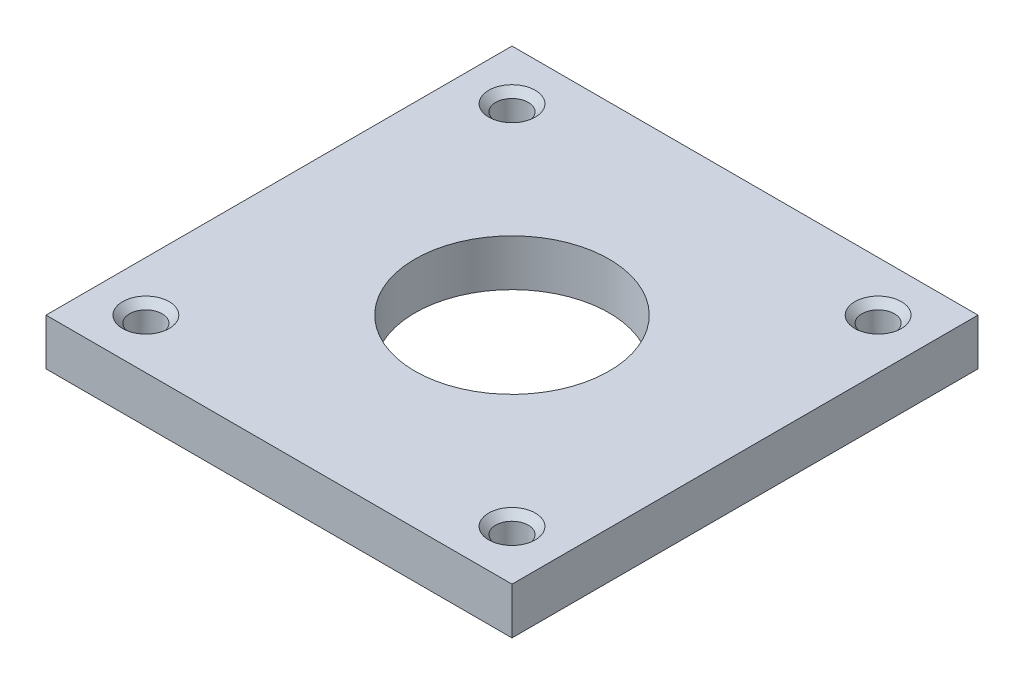
ISO-10303-21;
HEADER;
FILE_DESCRIPTION(('STEP AP214'),'2;1');
FILE_NAME('part.step','',(''),(''),'','','');
FILE_SCHEMA(('AUTOMOTIVE_DESIGN { 1 0 10303 214 1 1 1 1 }'));
ENDSEC;
DATA;
#1=APPLICATION_CONTEXT('core data for automotive mechanical design processes');
#2=APPLICATION_PROTOCOL_DEFINITION('international standard','automotive_design',2000,#1);
#3=PRODUCT_CONTEXT('',#1,'mechanical');
#4=PRODUCT('Part','Part','',(#3));
#5=PRODUCT_RELATED_PRODUCT_CATEGORY('part','',(#4));
#6=PRODUCT_DEFINITION_FORMATION('','',#4);
#7=PRODUCT_DEFINITION_CONTEXT('part definition',#1,'design');
#8=PRODUCT_DEFINITION('design','',#6,#7);
#9=PRODUCT_DEFINITION_SHAPE('','',#8);
#10=(LENGTH_UNIT() NAMED_UNIT(*) SI_UNIT(.MILLI.,.METRE.));
#11=(NAMED_UNIT(*) PLANE_ANGLE_UNIT() SI_UNIT($,.RADIAN.));
#12=(NAMED_UNIT(*) SI_UNIT($,.STERADIAN.) SOLID_ANGLE_UNIT());
#13=UNCERTAINTY_MEASURE_WITH_UNIT(LENGTH_MEASURE(1.E-05),#10,'distance_accuracy_value','');
#14=(GEOMETRIC_REPRESENTATION_CONTEXT(3) GLOBAL_UNCERTAINTY_ASSIGNED_CONTEXT((#13)) GLOBAL_UNIT_ASSIGNED_CONTEXT((#10,
#11,#12)) REPRESENTATION_CONTEXT('',''));
#15=CARTESIAN_POINT('',(0.,0.,0.));
#16=DIRECTION('',(0.,0.,1.));
#17=DIRECTION('',(1.,0.,0.));
#18=AXIS2_PLACEMENT_3D('',#15,#16,#17);
#19=CARTESIAN_POINT('',(0.,6.,0.));
#20=DIRECTION('',(0.,1.,0.));
#21=DIRECTION('',(0.,0.,1.));
#22=AXIS2_PLACEMENT_3D('',#19,#20,#21);
#23=PLANE('',#22);
#24=CARTESIAN_POINT('',(-23.57,6.,86.5280111423957));
#25=DIRECTION('',(0.,1.,0.));
#26=DIRECTION('',(0.,0.,1.));
#27=AXIS2_PLACEMENT_3D('',#24,#25,#26);
#28=CIRCLE('',#27,3.);
#29=CARTESIAN_POINT('',(-23.57,6.,89.5280111423957));
#30=VERTEX_POINT('',#29);
#31=EDGE_CURVE('E215',#30,#30,#28,.T.);
#32=ORIENTED_EDGE('',*,*,#31,.F.);
#33=EDGE_LOOP('',(#32));
#34=FACE_BOUND('',#33,.T.);
#35=CARTESIAN_POINT('',(23.57,6.,86.5280111423957));
#36=DIRECTION('',(0.,1.,0.));
#37=DIRECTION('',(0.,0.,1.));
#38=AXIS2_PLACEMENT_3D('',#35,#36,#37);
#39=CIRCLE('',#38,3.);
#40=CARTESIAN_POINT('',(23.57,6.,89.5280111423957));
#41=VERTEX_POINT('',#40);
#42=EDGE_CURVE('E200',#41,#41,#39,.T.);
#43=ORIENTED_EDGE('',*,*,#42,.F.);
#44=EDGE_LOOP('',(#43));
#45=FACE_BOUND('',#44,.T.);
#46=CARTESIAN_POINT('',(23.57,6.,133.668011142396));
#47=DIRECTION('',(0.,1.,0.));
#48=DIRECTION('',(0.,0.,1.));
#49=AXIS2_PLACEMENT_3D('',#46,#47,#48);
#50=CIRCLE('',#49,3.);
#51=CARTESIAN_POINT('',(23.57,6.,136.668011142396));
#52=VERTEX_POINT('',#51);
#53=EDGE_CURVE('E184',#52,#52,#50,.T.);
#54=ORIENTED_EDGE('',*,*,#53,.F.);
#55=EDGE_LOOP('',(#54));
#56=FACE_BOUND('',#55,.T.);
#57=CARTESIAN_POINT('',(-23.57,6.,133.668011142396));
#58=DIRECTION('',(0.,1.,0.));
#59=DIRECTION('',(0.,0.,1.));
#60=AXIS2_PLACEMENT_3D('',#57,#58,#59);
#61=CIRCLE('',#60,3.);
#62=CARTESIAN_POINT('',(-23.57,6.,136.668011142396));
#63=VERTEX_POINT('',#62);
#64=EDGE_CURVE('E170',#63,#63,#61,.T.);
#65=ORIENTED_EDGE('',*,*,#64,.F.);
#66=EDGE_LOOP('',(#65));
#67=FACE_BOUND('',#66,.T.);
#68=DIRECTION('',(0.,0.,1.));
#69=VECTOR('',#68,1.);
#70=CARTESIAN_POINT('',(-30.,6.,80.0980111423957));
#71=LINE('',#70,#69);
#72=CARTESIAN_POINT('',(-30.,6.,80.0980111423957));
#73=VERTEX_POINT('',#72);
#74=CARTESIAN_POINT('',(-30.,6.,140.098011142396));
#75=VERTEX_POINT('',#74);
#76=EDGE_CURVE('E111',#73,#75,#71,.T.);
#77=ORIENTED_EDGE('',*,*,#76,.T.);
#78=DIRECTION('',(1.,0.,0.));
#79=VECTOR('',#78,1.);
#80=CARTESIAN_POINT('',(-30.,6.,140.098011142396));
#81=LINE('',#80,#79);
#82=CARTESIAN_POINT('',(30.,6.,140.098011142396));
#83=VERTEX_POINT('',#82);
#84=EDGE_CURVE('E106',#75,#83,#81,.T.);
#85=ORIENTED_EDGE('',*,*,#84,.T.);
#86=DIRECTION('',(0.,0.,-1.));
#87=VECTOR('',#86,1.);
#88=CARTESIAN_POINT('',(30.,6.,140.098011142396));
#89=LINE('',#88,#87);
#90=CARTESIAN_POINT('',(30.,6.,80.0980111423957));
#91=VERTEX_POINT('',#90);
#92=EDGE_CURVE('E109',#83,#91,#89,.T.);
#93=ORIENTED_EDGE('',*,*,#92,.T.);
#94=DIRECTION('',(-1.,0.,0.));
#95=VECTOR('',#94,1.);
#96=CARTESIAN_POINT('',(-30.,6.,80.0980111423957));
#97=LINE('',#96,#95);
#98=EDGE_CURVE('E76',#91,#73,#97,.T.);
#99=ORIENTED_EDGE('',*,*,#98,.T.);
#100=EDGE_LOOP('',(#77,#85,#93,#99));
#101=FACE_BOUND('',#100,.T.);
#102=CARTESIAN_POINT('',(0.,6.,110.098011142396));
#103=DIRECTION('',(0.,1.,0.));
#104=DIRECTION('',(0.,0.,1.));
#105=AXIS2_PLACEMENT_3D('',#102,#103,#104);
#106=CIRCLE('',#105,12.5);
#107=CARTESIAN_POINT('',(0.,6.,122.598011142396));
#108=VERTEX_POINT('',#107);
#109=EDGE_CURVE('E134',#108,#108,#106,.T.);
#110=ORIENTED_EDGE('',*,*,#109,.F.);
#111=EDGE_LOOP('',(#110));
#112=FACE_BOUND('',#111,.T.);
#113=ADVANCED_FACE('F58',(#34,#45,#56,#67,#101,#112),#23,.T.);
#114=CARTESIAN_POINT('',(0.,0.,0.));
#115=DIRECTION('',(0.,1.,0.));
#116=DIRECTION('',(0.,0.,1.));
#117=AXIS2_PLACEMENT_3D('',#114,#115,#116);
#118=PLANE('',#117);
#119=CARTESIAN_POINT('',(-23.57,0.,86.5280111423957));
#120=DIRECTION('',(0.,1.,0.));
#121=DIRECTION('',(0.,0.,1.));
#122=AXIS2_PLACEMENT_3D('',#119,#120,#121);
#123=CIRCLE('',#122,3.);
#124=CARTESIAN_POINT('',(-23.57,0.,89.5280111423957));
#125=VERTEX_POINT('',#124);
#126=EDGE_CURVE('E219',#125,#125,#123,.T.);
#127=ORIENTED_EDGE('',*,*,#126,.T.);
#128=EDGE_LOOP('',(#127));
#129=FACE_BOUND('',#128,.T.);
#130=CARTESIAN_POINT('',(23.57,0.,86.5280111423957));
#131=DIRECTION('',(0.,1.,0.));
#132=DIRECTION('',(0.,0.,1.));
#133=AXIS2_PLACEMENT_3D('',#130,#131,#132);
#134=CIRCLE('',#133,3.);
#135=CARTESIAN_POINT('',(23.57,0.,89.5280111423957));
#136=VERTEX_POINT('',#135);
#137=EDGE_CURVE('E203',#136,#136,#134,.T.);
#138=ORIENTED_EDGE('',*,*,#137,.T.);
#139=EDGE_LOOP('',(#138));
#140=FACE_BOUND('',#139,.T.);
#141=CARTESIAN_POINT('',(23.57,0.,133.668011142396));
#142=DIRECTION('',(0.,1.,0.));
#143=DIRECTION('',(0.,0.,1.));
#144=AXIS2_PLACEMENT_3D('',#141,#142,#143);
#145=CIRCLE('',#144,3.);
#146=CARTESIAN_POINT('',(23.57,0.,136.668011142396));
#147=VERTEX_POINT('',#146);
#148=EDGE_CURVE('E188',#147,#147,#145,.T.);
#149=ORIENTED_EDGE('',*,*,#148,.T.);
#150=EDGE_LOOP('',(#149));
#151=FACE_BOUND('',#150,.T.);
#152=CARTESIAN_POINT('',(-23.57,0.,133.668011142396));
#153=DIRECTION('',(0.,1.,0.));
#154=DIRECTION('',(0.,0.,1.));
#155=AXIS2_PLACEMENT_3D('',#152,#153,#154);
#156=CIRCLE('',#155,3.);
#157=CARTESIAN_POINT('',(-23.57,0.,136.668011142396));
#158=VERTEX_POINT('',#157);
#159=EDGE_CURVE('E174',#158,#158,#156,.T.);
#160=ORIENTED_EDGE('',*,*,#159,.T.);
#161=EDGE_LOOP('',(#160));
#162=FACE_BOUND('',#161,.T.);
#163=DIRECTION('',(0.,0.,1.));
#164=VECTOR('',#163,1.);
#165=CARTESIAN_POINT('',(-30.,0.,80.0980111423957));
#166=LINE('',#165,#164);
#167=CARTESIAN_POINT('',(-30.,0.,80.0980111423957));
#168=VERTEX_POINT('',#167);
#169=CARTESIAN_POINT('',(-30.,0.,140.098011142396));
#170=VERTEX_POINT('',#169);
#171=EDGE_CURVE('E130',#168,#170,#166,.T.);
#172=ORIENTED_EDGE('',*,*,#171,.F.);
#173=DIRECTION('',(-1.,0.,0.));
#174=VECTOR('',#173,1.);
#175=CARTESIAN_POINT('',(-30.,0.,80.0980111423957));
#176=LINE('',#175,#174);
#177=CARTESIAN_POINT('',(30.,0.,80.0980111423957));
#178=VERTEX_POINT('',#177);
#179=EDGE_CURVE('E99',#178,#168,#176,.T.);
#180=ORIENTED_EDGE('',*,*,#179,.F.);
#181=DIRECTION('',(0.,0.,-1.));
#182=VECTOR('',#181,1.);
#183=CARTESIAN_POINT('',(30.,0.,140.098011142396));
#184=LINE('',#183,#182);
#185=CARTESIAN_POINT('',(30.,0.,140.098011142396));
#186=VERTEX_POINT('',#185);
#187=EDGE_CURVE('E93',#186,#178,#184,.T.);
#188=ORIENTED_EDGE('',*,*,#187,.F.);
#189=DIRECTION('',(1.,0.,0.));
#190=VECTOR('',#189,1.);
#191=CARTESIAN_POINT('',(-30.,0.,140.098011142396));
#192=LINE('',#191,#190);
#193=EDGE_CURVE('E116',#170,#186,#192,.T.);
#194=ORIENTED_EDGE('',*,*,#193,.F.);
#195=EDGE_LOOP('',(#172,#180,#188,#194));
#196=FACE_BOUND('',#195,.T.);
#197=CARTESIAN_POINT('',(0.,0.,110.098011142396));
#198=DIRECTION('',(0.,1.,0.));
#199=DIRECTION('',(0.,0.,1.));
#200=AXIS2_PLACEMENT_3D('',#197,#198,#199);
#201=CIRCLE('',#200,12.5);
#202=CARTESIAN_POINT('',(0.,0.,122.598011142396));
#203=VERTEX_POINT('',#202);
#204=EDGE_CURVE('E156',#203,#203,#201,.T.);
#205=ORIENTED_EDGE('',*,*,#204,.T.);
#206=EDGE_LOOP('',(#205));
#207=FACE_BOUND('',#206,.T.);
#208=ADVANCED_FACE('F149',(#129,#140,#151,#162,#196,#207),#118,.F.);
#209=CARTESIAN_POINT('',(-30.,6.,80.0980111423957));
#210=DIRECTION('',(1.,0.,0.));
#211=DIRECTION('',(0.,0.,-1.));
#212=AXIS2_PLACEMENT_3D('',#209,#210,#211);
#213=PLANE('',#212);
#214=ORIENTED_EDGE('',*,*,#171,.T.);
#215=DIRECTION('',(0.,-1.,0.));
#216=VECTOR('',#215,1.);
#217=CARTESIAN_POINT('',(-30.,6.,140.098011142396));
#218=LINE('',#217,#216);
#219=EDGE_CURVE('E11',#75,#170,#218,.T.);
#220=ORIENTED_EDGE('',*,*,#219,.F.);
#221=ORIENTED_EDGE('',*,*,#76,.F.);
#222=DIRECTION('',(0.,-1.,0.));
#223=VECTOR('',#222,1.);
#224=CARTESIAN_POINT('',(-30.,6.,80.0980111423957));
#225=LINE('',#224,#223);
#226=EDGE_CURVE('E126',#73,#168,#225,.T.);
#227=ORIENTED_EDGE('',*,*,#226,.T.);
#228=EDGE_LOOP('',(#214,#220,#221,#227));
#229=FACE_BOUND('',#228,.T.);
#230=ADVANCED_FACE('F60',(#229),#213,.F.);
#231=CARTESIAN_POINT('',(-30.,6.,140.098011142396));
#232=DIRECTION('',(0.,0.,-1.));
#233=DIRECTION('',(-1.,0.,0.));
#234=AXIS2_PLACEMENT_3D('',#231,#232,#233);
#235=PLANE('',#234);
#236=ORIENTED_EDGE('',*,*,#193,.T.);
#237=DIRECTION('',(0.,-1.,0.));
#238=VECTOR('',#237,1.);
#239=CARTESIAN_POINT('',(30.,6.,140.098011142396));
#240=LINE('',#239,#238);
#241=EDGE_CURVE('E68',#83,#186,#240,.T.);
#242=ORIENTED_EDGE('',*,*,#241,.F.);
#243=ORIENTED_EDGE('',*,*,#84,.F.);
#244=ORIENTED_EDGE('',*,*,#219,.T.);
#245=EDGE_LOOP('',(#236,#242,#243,#244));
#246=FACE_BOUND('',#245,.T.);
#247=ADVANCED_FACE('F115',(#246),#235,.F.);
#248=CARTESIAN_POINT('',(30.,6.,140.098011142396));
#249=DIRECTION('',(-1.,0.,0.));
#250=DIRECTION('',(0.,0.,1.));
#251=AXIS2_PLACEMENT_3D('',#248,#249,#250);
#252=PLANE('',#251);
#253=ORIENTED_EDGE('',*,*,#187,.T.);
#254=DIRECTION('',(0.,-1.,0.));
#255=VECTOR('',#254,1.);
#256=CARTESIAN_POINT('',(30.,6.,80.0980111423957));
#257=LINE('',#256,#255);
#258=EDGE_CURVE('E118',#91,#178,#257,.T.);
#259=ORIENTED_EDGE('',*,*,#258,.F.);
#260=ORIENTED_EDGE('',*,*,#92,.F.);
#261=ORIENTED_EDGE('',*,*,#241,.T.);
#262=EDGE_LOOP('',(#253,#259,#260,#261));
#263=FACE_BOUND('',#262,.T.);
#264=ADVANCED_FACE('F119',(#263),#252,.F.);
#265=CARTESIAN_POINT('',(-30.,6.,80.0980111423957));
#266=DIRECTION('',(0.,0.,1.));
#267=DIRECTION('',(1.,0.,0.));
#268=AXIS2_PLACEMENT_3D('',#265,#266,#267);
#269=PLANE('',#268);
#270=ORIENTED_EDGE('',*,*,#179,.T.);
#271=ORIENTED_EDGE('',*,*,#226,.F.);
#272=ORIENTED_EDGE('',*,*,#98,.F.);
#273=ORIENTED_EDGE('',*,*,#258,.T.);
#274=EDGE_LOOP('',(#270,#271,#272,#273));
#275=FACE_BOUND('',#274,.T.);
#276=ADVANCED_FACE('F146',(#275),#269,.F.);
#277=CARTESIAN_POINT('',(0.,6.,110.098011142396));
#278=DIRECTION('',(0.,-1.,0.));
#279=DIRECTION('',(0.,0.,-1.));
#280=AXIS2_PLACEMENT_3D('',#277,#278,#279);
#281=CYLINDRICAL_SURFACE('',#280,12.5);
#282=ORIENTED_EDGE('',*,*,#109,.T.);
#283=EDGE_LOOP('',(#282));
#284=FACE_BOUND('',#283,.T.);
#285=ORIENTED_EDGE('',*,*,#204,.F.);
#286=EDGE_LOOP('',(#285));
#287=FACE_BOUND('',#286,.T.);
#288=ADVANCED_FACE('F276',(#284,#287),#281,.F.);
#289=CARTESIAN_POINT('',(-23.57,0.900000000000003,133.668011142396));
#290=DIRECTION('',(0.,-1.,0.));
#291=DIRECTION('',(0.,0.,-1.));
#292=AXIS2_PLACEMENT_3D('',#289,#290,#291);
#293=CONICAL_SURFACE('',#292,2.1,0.785398163397448);
#294=ORIENTED_EDGE('',*,*,#159,.F.);
#295=EDGE_LOOP('',(#294));
#296=FACE_BOUND('',#295,.T.);
#297=CARTESIAN_POINT('',(-23.57,0.900000000000003,133.668011142396));
#298=DIRECTION('',(0.,1.,0.));
#299=DIRECTION('',(0.,0.,1.));
#300=AXIS2_PLACEMENT_3D('',#297,#298,#299);
#301=CIRCLE('',#300,2.1);
#302=CARTESIAN_POINT('',(-23.57,0.900000000000003,135.768011142396));
#303=VERTEX_POINT('',#302);
#304=EDGE_CURVE('E160',#303,#303,#301,.T.);
#305=ORIENTED_EDGE('',*,*,#304,.T.);
#306=EDGE_LOOP('',(#305));
#307=FACE_BOUND('',#306,.T.);
#308=ADVANCED_FACE('F268',(#296,#307),#293,.F.);
#309=CARTESIAN_POINT('',(-23.57,6.,133.668011142396));
#310=DIRECTION('',(0.,1.,0.));
#311=DIRECTION('',(0.,0.,1.));
#312=AXIS2_PLACEMENT_3D('',#309,#310,#311);
#313=CYLINDRICAL_SURFACE('',#312,2.1);
#314=ORIENTED_EDGE('',*,*,#304,.F.);
#315=EDGE_LOOP('',(#314));
#316=FACE_BOUND('',#315,.T.);
#317=CARTESIAN_POINT('',(-23.57,5.1,133.668011142396));
#318=DIRECTION('',(0.,1.,0.));
#319=DIRECTION('',(0.,0.,1.));
#320=AXIS2_PLACEMENT_3D('',#317,#318,#319);
#321=CIRCLE('',#320,2.1);
#322=CARTESIAN_POINT('',(-23.57,5.1,135.768011142396));
#323=VERTEX_POINT('',#322);
#324=EDGE_CURVE('E166',#323,#323,#321,.T.);
#325=ORIENTED_EDGE('',*,*,#324,.T.);
#326=EDGE_LOOP('',(#325));
#327=FACE_BOUND('',#326,.T.);
#328=ADVANCED_FACE('F258',(#316,#327),#313,.F.);
#329=CARTESIAN_POINT('',(-23.57,6.,133.668011142396));
#330=DIRECTION('',(0.,1.,0.));
#331=DIRECTION('',(0.,0.,1.));
#332=AXIS2_PLACEMENT_3D('',#329,#330,#331);
#333=CONICAL_SURFACE('',#332,3.,0.785398163397446);
#334=ORIENTED_EDGE('',*,*,#324,.F.);
#335=EDGE_LOOP('',(#334));
#336=FACE_BOUND('',#335,.T.);
#337=ORIENTED_EDGE('',*,*,#64,.T.);
#338=EDGE_LOOP('',(#337));
#339=FACE_BOUND('',#338,.T.);
#340=ADVANCED_FACE('F255',(#336,#339),#333,.F.);
#341=CARTESIAN_POINT('',(23.57,0.900000000000003,133.668011142396));
#342=DIRECTION('',(0.,-1.,0.));
#343=DIRECTION('',(0.,0.,-1.));
#344=AXIS2_PLACEMENT_3D('',#341,#342,#343);
#345=CONICAL_SURFACE('',#344,2.1,0.785398163397448);
#346=ORIENTED_EDGE('',*,*,#148,.F.);
#347=EDGE_LOOP('',(#346));
#348=FACE_BOUND('',#347,.T.);
#349=CARTESIAN_POINT('',(23.57,0.900000000000003,133.668011142396));
#350=DIRECTION('',(0.,1.,0.));
#351=DIRECTION('',(0.,0.,1.));
#352=AXIS2_PLACEMENT_3D('',#349,#350,#351);
#353=CIRCLE('',#352,2.1);
#354=CARTESIAN_POINT('',(23.57,0.900000000000003,135.768011142396));
#355=VERTEX_POINT('',#354);
#356=EDGE_CURVE('E178',#355,#355,#353,.T.);
#357=ORIENTED_EDGE('',*,*,#356,.T.);
#358=EDGE_LOOP('',(#357));
#359=FACE_BOUND('',#358,.T.);
#360=ADVANCED_FACE('F257',(#348,#359),#345,.F.);
#361=CARTESIAN_POINT('',(23.57,6.,133.668011142396));
#362=DIRECTION('',(0.,1.,0.));
#363=DIRECTION('',(0.,0.,1.));
#364=AXIS2_PLACEMENT_3D('',#361,#362,#363);
#365=CYLINDRICAL_SURFACE('',#364,2.1);
#366=ORIENTED_EDGE('',*,*,#356,.F.);
#367=EDGE_LOOP('',(#366));
#368=FACE_BOUND('',#367,.T.);
#369=CARTESIAN_POINT('',(23.57,5.1,133.668011142396));
#370=DIRECTION('',(0.,1.,0.));
#371=DIRECTION('',(0.,0.,1.));
#372=AXIS2_PLACEMENT_3D('',#369,#370,#371);
#373=CIRCLE('',#372,2.1);
#374=CARTESIAN_POINT('',(23.57,5.1,135.768011142396));
#375=VERTEX_POINT('',#374);
#376=EDGE_CURVE('E181',#375,#375,#373,.T.);
#377=ORIENTED_EDGE('',*,*,#376,.T.);
#378=EDGE_LOOP('',(#377));
#379=FACE_BOUND('',#378,.T.);
#380=ADVANCED_FACE('F264',(#368,#379),#365,.F.);
#381=CARTESIAN_POINT('',(23.57,6.,133.668011142396));
#382=DIRECTION('',(0.,1.,0.));
#383=DIRECTION('',(0.,0.,1.));
#384=AXIS2_PLACEMENT_3D('',#381,#382,#383);
#385=CONICAL_SURFACE('',#384,3.,0.785398163397446);
#386=ORIENTED_EDGE('',*,*,#376,.F.);
#387=EDGE_LOOP('',(#386));
#388=FACE_BOUND('',#387,.T.);
#389=ORIENTED_EDGE('',*,*,#53,.T.);
#390=EDGE_LOOP('',(#389));
#391=FACE_BOUND('',#390,.T.);
#392=ADVANCED_FACE('F366',(#388,#391),#385,.F.);
#393=CARTESIAN_POINT('',(23.57,0.900000000000003,86.5280111423957));
#394=DIRECTION('',(0.,-1.,0.));
#395=DIRECTION('',(0.,0.,-1.));
#396=AXIS2_PLACEMENT_3D('',#393,#394,#395);
#397=CONICAL_SURFACE('',#396,2.1,0.785398163397448);
#398=ORIENTED_EDGE('',*,*,#137,.F.);
#399=EDGE_LOOP('',(#398));
#400=FACE_BOUND('',#399,.T.);
#401=CARTESIAN_POINT('',(23.57,0.900000000000003,86.5280111423957));
#402=DIRECTION('',(0.,1.,0.));
#403=DIRECTION('',(0.,0.,1.));
#404=AXIS2_PLACEMENT_3D('',#401,#402,#403);
#405=CIRCLE('',#404,2.1);
#406=CARTESIAN_POINT('',(23.57,0.900000000000003,88.6280111423957));
#407=VERTEX_POINT('',#406);
#408=EDGE_CURVE('E192',#407,#407,#405,.T.);
#409=ORIENTED_EDGE('',*,*,#408,.T.);
#410=EDGE_LOOP('',(#409));
#411=FACE_BOUND('',#410,.T.);
#412=ADVANCED_FACE('F375',(#400,#411),#397,.F.);
#413=CARTESIAN_POINT('',(23.57,6.,86.5280111423957));
#414=DIRECTION('',(0.,1.,0.));
#415=DIRECTION('',(0.,0.,1.));
#416=AXIS2_PLACEMENT_3D('',#413,#414,#415);
#417=CYLINDRICAL_SURFACE('',#416,2.1);
#418=ORIENTED_EDGE('',*,*,#408,.F.);
#419=EDGE_LOOP('',(#418));
#420=FACE_BOUND('',#419,.T.);
#421=CARTESIAN_POINT('',(23.57,5.1,86.5280111423957));
#422=DIRECTION('',(0.,1.,0.));
#423=DIRECTION('',(0.,0.,1.));
#424=AXIS2_PLACEMENT_3D('',#421,#422,#423);
#425=CIRCLE('',#424,2.1);
#426=CARTESIAN_POINT('',(23.57,5.1,88.6280111423957));
#427=VERTEX_POINT('',#426);
#428=EDGE_CURVE('E196',#427,#427,#425,.T.);
#429=ORIENTED_EDGE('',*,*,#428,.T.);
#430=EDGE_LOOP('',(#429));
#431=FACE_BOUND('',#430,.T.);
#432=ADVANCED_FACE('F385',(#420,#431),#417,.F.);
#433=CARTESIAN_POINT('',(23.57,6.,86.5280111423957));
#434=DIRECTION('',(0.,1.,0.));
#435=DIRECTION('',(0.,0.,1.));
#436=AXIS2_PLACEMENT_3D('',#433,#434,#435);
#437=CONICAL_SURFACE('',#436,3.,0.785398163397446);
#438=ORIENTED_EDGE('',*,*,#428,.F.);
#439=EDGE_LOOP('',(#438));
#440=FACE_BOUND('',#439,.T.);
#441=ORIENTED_EDGE('',*,*,#42,.T.);
#442=EDGE_LOOP('',(#441));
#443=FACE_BOUND('',#442,.T.);
#444=ADVANCED_FACE('F231',(#440,#443),#437,.F.);
#445=CARTESIAN_POINT('',(-23.57,0.900000000000003,86.5280111423957));
#446=DIRECTION('',(0.,-1.,0.));
#447=DIRECTION('',(0.,0.,-1.));
#448=AXIS2_PLACEMENT_3D('',#445,#446,#447);
#449=CONICAL_SURFACE('',#448,2.1,0.785398163397448);
#450=ORIENTED_EDGE('',*,*,#126,.F.);
#451=EDGE_LOOP('',(#450));
#452=FACE_BOUND('',#451,.T.);
#453=CARTESIAN_POINT('',(-23.57,0.900000000000003,86.5280111423957));
#454=DIRECTION('',(0.,1.,0.));
#455=DIRECTION('',(0.,0.,1.));
#456=AXIS2_PLACEMENT_3D('',#453,#454,#455);
#457=CIRCLE('',#456,2.1);
#458=CARTESIAN_POINT('',(-23.57,0.900000000000003,88.6280111423957));
#459=VERTEX_POINT('',#458);
#460=EDGE_CURVE('E207',#459,#459,#457,.T.);
#461=ORIENTED_EDGE('',*,*,#460,.T.);
#462=EDGE_LOOP('',(#461));
#463=FACE_BOUND('',#462,.T.);
#464=ADVANCED_FACE('F227',(#452,#463),#449,.F.);
#465=CARTESIAN_POINT('',(-23.57,6.,86.5280111423957));
#466=DIRECTION('',(0.,1.,0.));
#467=DIRECTION('',(0.,0.,1.));
#468=AXIS2_PLACEMENT_3D('',#465,#466,#467);
#469=CYLINDRICAL_SURFACE('',#468,2.1);
#470=ORIENTED_EDGE('',*,*,#460,.F.);
#471=EDGE_LOOP('',(#470));
#472=FACE_BOUND('',#471,.T.);
#473=CARTESIAN_POINT('',(-23.57,5.1,86.5280111423957));
#474=DIRECTION('',(0.,1.,0.));
#475=DIRECTION('',(0.,0.,1.));
#476=AXIS2_PLACEMENT_3D('',#473,#474,#475);
#477=CIRCLE('',#476,2.1);
#478=CARTESIAN_POINT('',(-23.57,5.1,88.6280111423957));
#479=VERTEX_POINT('',#478);
#480=EDGE_CURVE('E211',#479,#479,#477,.T.);
#481=ORIENTED_EDGE('',*,*,#480,.T.);
#482=EDGE_LOOP('',(#481));
#483=FACE_BOUND('',#482,.T.);
#484=ADVANCED_FACE('F230',(#472,#483),#469,.F.);
#485=CARTESIAN_POINT('',(-23.57,6.,86.5280111423957));
#486=DIRECTION('',(0.,1.,0.));
#487=DIRECTION('',(0.,0.,1.));
#488=AXIS2_PLACEMENT_3D('',#485,#486,#487);
#489=CONICAL_SURFACE('',#488,3.,0.785398163397446);
#490=ORIENTED_EDGE('',*,*,#480,.F.);
#491=EDGE_LOOP('',(#490));
#492=FACE_BOUND('',#491,.T.);
#493=ORIENTED_EDGE('',*,*,#31,.T.);
#494=EDGE_LOOP('',(#493));
#495=FACE_BOUND('',#494,.T.);
#496=ADVANCED_FACE('F237',(#492,#495),#489,.F.);
#497=CLOSED_SHELL('',(#113,#208,#230,#247,#264,#276,#288,#308,#328,#340,#360,#380,#392,#412,
#432,#444,#464,#484,#496));
#498=MANIFOLD_SOLID_BREP('B2',#497);
#499=ADVANCED_BREP_SHAPE_REPRESENTATION('',(#18,#498),#14);
#500=SHAPE_DEFINITION_REPRESENTATION(#9,#499);
ENDSEC;
END-ISO-10303-21;
